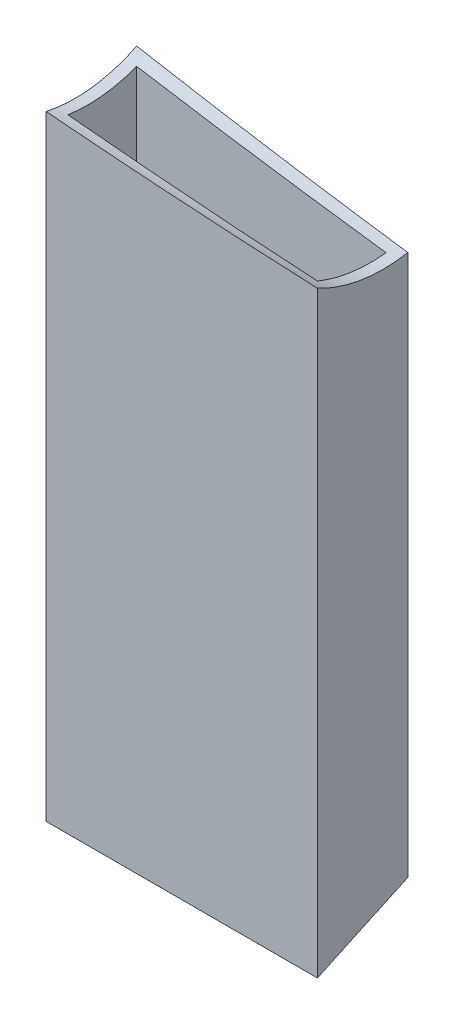
ISO-10303-21;
HEADER;
FILE_DESCRIPTION(('STEP AP214'),'2;1');
FILE_NAME('part.step','',(''),(''),'','','');
FILE_SCHEMA(('AUTOMOTIVE_DESIGN { 1 0 10303 214 1 1 1 1 }'));
ENDSEC;
DATA;
#1=APPLICATION_CONTEXT('core data for automotive mechanical design processes');
#2=APPLICATION_PROTOCOL_DEFINITION('international standard','automotive_design',2000,#1);
#3=PRODUCT_CONTEXT('',#1,'mechanical');
#4=PRODUCT('Part','Part','',(#3));
#5=PRODUCT_RELATED_PRODUCT_CATEGORY('part','',(#4));
#6=PRODUCT_DEFINITION_FORMATION('','',#4);
#7=PRODUCT_DEFINITION_CONTEXT('part definition',#1,'design');
#8=PRODUCT_DEFINITION('design','',#6,#7);
#9=PRODUCT_DEFINITION_SHAPE('','',#8);
#10=(LENGTH_UNIT() NAMED_UNIT(*) SI_UNIT(.MILLI.,.METRE.));
#11=(NAMED_UNIT(*) PLANE_ANGLE_UNIT() SI_UNIT($,.RADIAN.));
#12=(NAMED_UNIT(*) SI_UNIT($,.STERADIAN.) SOLID_ANGLE_UNIT());
#13=UNCERTAINTY_MEASURE_WITH_UNIT(LENGTH_MEASURE(1.E-05),#10,'distance_accuracy_value','');
#14=(GEOMETRIC_REPRESENTATION_CONTEXT(3) GLOBAL_UNCERTAINTY_ASSIGNED_CONTEXT((#13)) GLOBAL_UNIT_ASSIGNED_CONTEXT((#10,
#11,#12)) REPRESENTATION_CONTEXT('',''));
#15=CARTESIAN_POINT('',(0.,0.,0.));
#16=DIRECTION('',(0.,0.,1.));
#17=DIRECTION('',(1.,0.,0.));
#18=AXIS2_PLACEMENT_3D('',#15,#16,#17);
#19=CARTESIAN_POINT('',(-38.1,200.,-12.7));
#20=DIRECTION('',(1.,0.,0.));
#21=DIRECTION('',(0.,0.,-1.));
#22=AXIS2_PLACEMENT_3D('',#19,#20,#21);
#23=PLANE('',#22);
#24=CARTESIAN_POINT('',(-38.1,204.338574419077,5.12923725627169));
#25=DIRECTION('',(1.,0.,0.));
#26=DIRECTION('',(0.,-0.645807827453337,-0.763500000000001));
#27=AXIS2_PLACEMENT_3D('',#24,#25,#26);
#28=ELLIPSE('',#27,38.6877539128469,38.1);
#29=CARTESIAN_POINT('',(-38.1,170.101029529485,-12.7));
#30=VERTEX_POINT('',#29);
#31=CARTESIAN_POINT('',(-38.1,166.86154722495,12.7));
#32=VERTEX_POINT('',#31);
#33=EDGE_CURVE('E168',#30,#32,#28,.F.);
#34=ORIENTED_EDGE('',*,*,#33,.F.);
#35=DIRECTION('',(0.,-1.,0.));
#36=VECTOR('',#35,1.);
#37=CARTESIAN_POINT('',(-38.1,200.,-12.7));
#38=LINE('',#37,#36);
#39=CARTESIAN_POINT('',(-38.1,5.89160522769183,-12.7));
#40=VERTEX_POINT('',#39);
#41=EDGE_CURVE('E124',#30,#40,#38,.T.);
#42=ORIENTED_EDGE('',*,*,#41,.T.);
#43=DIRECTION('',(0.,-0.420827858242934,0.907140514874441));
#44=VECTOR('',#43,1.);
#45=CARTESIAN_POINT('',(-38.1,-8.7885305791334,18.9446397104788));
#46=LINE('',#45,#44);
#47=CARTESIAN_POINT('',(-38.1,-5.89160522769178,12.7));
#48=VERTEX_POINT('',#47);
#49=EDGE_CURVE('E161',#40,#48,#46,.T.);
#50=ORIENTED_EDGE('',*,*,#49,.T.);
#51=DIRECTION('',(0.,-1.,0.));
#52=VECTOR('',#51,1.);
#53=CARTESIAN_POINT('',(-38.1,200.,12.7));
#54=LINE('',#53,#52);
#55=EDGE_CURVE('E130',#32,#48,#54,.T.);
#56=ORIENTED_EDGE('',*,*,#55,.F.);
#57=EDGE_LOOP('',(#34,#42,#50,#56));
#58=FACE_BOUND('',#57,.T.);
#59=ADVANCED_FACE('F36',(#58),#23,.F.);
#60=CARTESIAN_POINT('',(-38.1,200.,12.7));
#61=DIRECTION('',(0.,0.,-1.));
#62=DIRECTION('',(-1.,0.,0.));
#63=AXIS2_PLACEMENT_3D('',#60,#61,#62);
#64=PLANE('',#63);
#65=CARTESIAN_POINT('',(-94.3356635352276,210.742317496604,12.7));
#66=DIRECTION('',(0.,0.,-1.));
#67=DIRECTION('',(0.993578812003704,-0.113142142181011,0.));
#68=AXIS2_PLACEMENT_3D('',#65,#66,#67);
#69=ELLIPSE('',#68,287.372829610709,38.1);
#70=CARTESIAN_POINT('',(38.1,161.960803613142,12.7));
#71=VERTEX_POINT('',#70);
#72=EDGE_CURVE('E172',#32,#71,#69,.F.);
#73=ORIENTED_EDGE('',*,*,#72,.F.);
#74=ORIENTED_EDGE('',*,*,#55,.T.);
#75=DIRECTION('',(1.,0.,0.));
#76=VECTOR('',#75,1.);
#77=CARTESIAN_POINT('',(-38.1,-5.89160522769178,12.7));
#78=LINE('',#77,#76);
#79=CARTESIAN_POINT('',(38.1,-5.89160522769177,12.7));
#80=VERTEX_POINT('',#79);
#81=EDGE_CURVE('E119',#48,#80,#78,.T.);
#82=ORIENTED_EDGE('',*,*,#81,.T.);
#83=DIRECTION('',(0.,-1.,0.));
#84=VECTOR('',#83,1.);
#85=CARTESIAN_POINT('',(38.1,200.,12.7));
#86=LINE('',#85,#84);
#87=EDGE_CURVE('E128',#71,#80,#86,.T.);
#88=ORIENTED_EDGE('',*,*,#87,.F.);
#89=EDGE_LOOP('',(#73,#74,#82,#88));
#90=FACE_BOUND('',#89,.T.);
#91=ADVANCED_FACE('F155',(#90),#64,.F.);
#92=CARTESIAN_POINT('',(38.1,200.,-12.7));
#93=DIRECTION('',(-1.,0.,0.));
#94=DIRECTION('',(0.,0.,1.));
#95=AXIS2_PLACEMENT_3D('',#92,#93,#94);
#96=PLANE('',#95);
#97=CARTESIAN_POINT('',(38.1,195.661425580923,-5.1292372562717));
#98=DIRECTION('',(-1.,0.,0.));
#99=DIRECTION('',(0.,-0.645807827453337,-0.763500000000001));
#100=AXIS2_PLACEMENT_3D('',#97,#98,#99);
#101=ELLIPSE('',#100,38.6877539128469,38.1);
#102=CARTESIAN_POINT('',(38.1,157.956406802283,-12.7));
#103=VERTEX_POINT('',#102);
#104=EDGE_CURVE('E50',#71,#103,#101,.F.);
#105=ORIENTED_EDGE('',*,*,#104,.F.);
#106=ORIENTED_EDGE('',*,*,#87,.T.);
#107=DIRECTION('',(0.,-0.420827858242934,0.907140514874441));
#108=VECTOR('',#107,1.);
#109=CARTESIAN_POINT('',(38.1,-8.7885305791334,18.9446397104788));
#110=LINE('',#109,#108);
#111=CARTESIAN_POINT('',(38.1,5.89160522769177,-12.7));
#112=VERTEX_POINT('',#111);
#113=EDGE_CURVE('E163',#112,#80,#110,.T.);
#114=ORIENTED_EDGE('',*,*,#113,.F.);
#115=DIRECTION('',(0.,-1.,0.));
#116=VECTOR('',#115,1.);
#117=CARTESIAN_POINT('',(38.1,200.,-12.7));
#118=LINE('',#117,#116);
#119=EDGE_CURVE('E126',#103,#112,#118,.T.);
#120=ORIENTED_EDGE('',*,*,#119,.F.);
#121=EDGE_LOOP('',(#105,#106,#114,#120));
#122=FACE_BOUND('',#121,.T.);
#123=ADVANCED_FACE('F193',(#122),#96,.F.);
#124=CARTESIAN_POINT('',(-38.1,200.,-12.7));
#125=DIRECTION('',(0.,0.,1.));
#126=DIRECTION('',(1.,0.,0.));
#127=AXIS2_PLACEMENT_3D('',#124,#125,#126);
#128=PLANE('',#127);
#129=CARTESIAN_POINT('',(94.3356635352274,189.257682503396,-12.7));
#130=DIRECTION('',(0.,0.,1.));
#131=DIRECTION('',(0.993578812003704,-0.113142142181011,0.));
#132=AXIS2_PLACEMENT_3D('',#129,#130,#131);
#133=ELLIPSE('',#132,287.372829610709,38.1);
#134=EDGE_CURVE('E175',#103,#30,#133,.F.);
#135=ORIENTED_EDGE('',*,*,#134,.F.);
#136=ORIENTED_EDGE('',*,*,#119,.T.);
#137=DIRECTION('',(-1.,0.,0.));
#138=VECTOR('',#137,1.);
#139=CARTESIAN_POINT('',(-38.1,5.89160522769178,-12.7));
#140=LINE('',#139,#138);
#141=EDGE_CURVE('E143',#112,#40,#140,.T.);
#142=ORIENTED_EDGE('',*,*,#141,.T.);
#143=ORIENTED_EDGE('',*,*,#41,.F.);
#144=EDGE_LOOP('',(#135,#136,#142,#143));
#145=FACE_BOUND('',#144,.T.);
#146=ADVANCED_FACE('F187',(#145),#128,.F.);
#147=CARTESIAN_POINT('',(-35.052,200.,-9.65199999999999));
#148=DIRECTION('',(1.,0.,0.));
#149=DIRECTION('',(0.,0.,-1.));
#150=AXIS2_PLACEMENT_3D('',#147,#148,#149);
#151=PLANE('',#150);
#152=DIRECTION('',(0.,-1.,0.));
#153=VECTOR('',#152,1.);
#154=CARTESIAN_POINT('',(-35.052,200.,-9.65199999999999));
#155=LINE('',#154,#153);
#156=CARTESIAN_POINT('',(-35.052,168.212925121954,-9.65199999999999));
#157=VERTEX_POINT('',#156);
#158=CARTESIAN_POINT('',(-35.052,4.47761997304577,-9.65199999999999));
#159=VERTEX_POINT('',#158);
#160=EDGE_CURVE('E115',#157,#159,#155,.T.);
#161=ORIENTED_EDGE('',*,*,#160,.F.);
#162=CARTESIAN_POINT('',(-35.052,203.991488465551,4.71889827576995));
#163=DIRECTION('',(1.,0.,0.));
#164=DIRECTION('',(0.,-0.645807827453337,-0.763500000000001));
#165=AXIS2_PLACEMENT_3D('',#162,#163,#164);
#166=ELLIPSE('',#165,38.6877539128469,38.1);
#167=CARTESIAN_POINT('',(-35.052,166.040888859006,9.652));
#168=VERTEX_POINT('',#167);
#169=EDGE_CURVE('E58',#157,#168,#166,.F.);
#170=ORIENTED_EDGE('',*,*,#169,.T.);
#171=DIRECTION('',(0.,-1.,0.));
#172=VECTOR('',#171,1.);
#173=CARTESIAN_POINT('',(-35.052,200.,9.652));
#174=LINE('',#173,#172);
#175=CARTESIAN_POINT('',(-35.052,-4.47761997304574,9.652));
#176=VERTEX_POINT('',#175);
#177=EDGE_CURVE('E117',#168,#176,#174,.T.);
#178=ORIENTED_EDGE('',*,*,#177,.T.);
#179=DIRECTION('',(0.,-0.420827858242934,0.907140514874441));
#180=VECTOR('',#179,1.);
#181=CARTESIAN_POINT('',(-35.052,39.103868254667,-84.2926685752904));
#182=LINE('',#181,#180);
#183=EDGE_CURVE('E137',#159,#176,#182,.T.);
#184=ORIENTED_EDGE('',*,*,#183,.F.);
#185=EDGE_LOOP('',(#161,#170,#178,#184));
#186=FACE_BOUND('',#185,.T.);
#187=ADVANCED_FACE('F141',(#186),#151,.T.);
#188=CARTESIAN_POINT('',(-35.052,200.,9.652));
#189=DIRECTION('',(0.,0.,-1.));
#190=DIRECTION('',(-1.,0.,0.));
#191=AXIS2_PLACEMENT_3D('',#188,#189,#190);
#192=PLANE('',#191);
#193=ORIENTED_EDGE('',*,*,#177,.F.);
#194=CARTESIAN_POINT('',(-71.695104286773,208.164161297419,9.65200000000001));
#195=DIRECTION('',(0.,0.,-1.));
#196=DIRECTION('',(0.993578812003704,-0.113142142181011,0.));
#197=AXIS2_PLACEMENT_3D('',#194,#195,#196);
#198=ELLIPSE('',#197,287.372829610709,38.1);
#199=CARTESIAN_POINT('',(35.052,160.662724118413,9.65199999999999));
#200=VERTEX_POINT('',#199);
#201=EDGE_CURVE('E110',#168,#200,#198,.F.);
#202=ORIENTED_EDGE('',*,*,#201,.T.);
#203=DIRECTION('',(0.,-1.,0.));
#204=VECTOR('',#203,1.);
#205=CARTESIAN_POINT('',(35.052,200.,9.65199999999999));
#206=LINE('',#205,#204);
#207=CARTESIAN_POINT('',(35.052,-4.47761997304574,9.65199999999998));
#208=VERTEX_POINT('',#207);
#209=EDGE_CURVE('E109',#200,#208,#206,.T.);
#210=ORIENTED_EDGE('',*,*,#209,.T.);
#211=DIRECTION('',(1.,0.,0.));
#212=VECTOR('',#211,1.);
#213=CARTESIAN_POINT('',(-35.052,-4.47761997304574,9.652));
#214=LINE('',#213,#212);
#215=EDGE_CURVE('E144',#176,#208,#214,.T.);
#216=ORIENTED_EDGE('',*,*,#215,.F.);
#217=EDGE_LOOP('',(#193,#202,#210,#216));
#218=FACE_BOUND('',#217,.T.);
#219=ADVANCED_FACE('F179',(#218),#192,.T.);
#220=CARTESIAN_POINT('',(35.052,200.,-9.652));
#221=DIRECTION('',(-1.,0.,0.));
#222=DIRECTION('',(0.,0.,1.));
#223=AXIS2_PLACEMENT_3D('',#220,#221,#222);
#224=PLANE('',#223);
#225=ORIENTED_EDGE('',*,*,#209,.F.);
#226=CARTESIAN_POINT('',(35.052,196.008511534449,-4.71889827576997));
#227=DIRECTION('',(-1.,0.,0.));
#228=DIRECTION('',(0.,-0.645807827453337,-0.763500000000001));
#229=AXIS2_PLACEMENT_3D('',#226,#227,#228);
#230=ELLIPSE('',#229,38.6877539128469,38.1);
#231=CARTESIAN_POINT('',(35.052,157.909352830659,-9.652));
#232=VERTEX_POINT('',#231);
#233=EDGE_CURVE('E98',#200,#232,#230,.F.);
#234=ORIENTED_EDGE('',*,*,#233,.T.);
#235=DIRECTION('',(0.,-1.,0.));
#236=VECTOR('',#235,1.);
#237=CARTESIAN_POINT('',(35.052,200.,-9.652));
#238=LINE('',#237,#236);
#239=CARTESIAN_POINT('',(35.052,4.47761997304583,-9.652));
#240=VERTEX_POINT('',#239);
#241=EDGE_CURVE('E107',#232,#240,#238,.T.);
#242=ORIENTED_EDGE('',*,*,#241,.T.);
#243=DIRECTION('',(0.,0.420827858242934,-0.907140514874441));
#244=VECTOR('',#243,1.);
#245=CARTESIAN_POINT('',(35.052,39.103868254667,-84.2926685752904));
#246=LINE('',#245,#244);
#247=EDGE_CURVE('E139',#208,#240,#246,.T.);
#248=ORIENTED_EDGE('',*,*,#247,.F.);
#249=EDGE_LOOP('',(#225,#234,#242,#248));
#250=FACE_BOUND('',#249,.T.);
#251=ADVANCED_FACE('F105',(#250),#224,.T.);
#252=CARTESIAN_POINT('',(-35.052,200.,-9.65199999999999));
#253=DIRECTION('',(0.,0.,1.));
#254=DIRECTION('',(1.,0.,0.));
#255=AXIS2_PLACEMENT_3D('',#252,#253,#254);
#256=PLANE('',#255);
#257=ORIENTED_EDGE('',*,*,#241,.F.);
#258=CARTESIAN_POINT('',(71.6951042867728,191.835838702581,-9.652));
#259=DIRECTION('',(0.,0.,1.));
#260=DIRECTION('',(0.993578812003704,-0.113142142181011,0.));
#261=AXIS2_PLACEMENT_3D('',#258,#259,#260);
#262=ELLIPSE('',#261,287.372829610709,38.1);
#263=EDGE_CURVE('E11',#232,#157,#262,.F.);
#264=ORIENTED_EDGE('',*,*,#263,.T.);
#265=ORIENTED_EDGE('',*,*,#160,.T.);
#266=DIRECTION('',(-1.,0.,0.));
#267=VECTOR('',#266,1.);
#268=CARTESIAN_POINT('',(-35.052,4.47761997304577,-9.65199999999999));
#269=LINE('',#268,#267);
#270=EDGE_CURVE('E43',#240,#159,#269,.T.);
#271=ORIENTED_EDGE('',*,*,#270,.F.);
#272=EDGE_LOOP('',(#257,#264,#265,#271));
#273=FACE_BOUND('',#272,.T.);
#274=ADVANCED_FACE('F113',(#273),#256,.T.);
#275=CARTESIAN_POINT('',(-38.1,-8.7885305791334,18.9446397104788));
#276=DIRECTION('',(0.,0.90714051487444,0.420827858242934));
#277=DIRECTION('',(0.,-0.420827858242934,0.907140514874441));
#278=AXIS2_PLACEMENT_3D('',#275,#276,#277);
#279=PLANE('',#278);
#280=ORIENTED_EDGE('',*,*,#183,.T.);
#281=ORIENTED_EDGE('',*,*,#215,.T.);
#282=ORIENTED_EDGE('',*,*,#247,.T.);
#283=ORIENTED_EDGE('',*,*,#270,.T.);
#284=EDGE_LOOP('',(#280,#281,#282,#283));
#285=FACE_BOUND('',#284,.T.);
#286=ORIENTED_EDGE('',*,*,#49,.F.);
#287=ORIENTED_EDGE('',*,*,#141,.F.);
#288=ORIENTED_EDGE('',*,*,#113,.T.);
#289=ORIENTED_EDGE('',*,*,#81,.F.);
#290=EDGE_LOOP('',(#286,#287,#288,#289));
#291=FACE_BOUND('',#290,.T.);
#292=ADVANCED_FACE('F134',(#285,#291),#279,.F.);
#293=CARTESIAN_POINT('',(-192.340643032274,221.902472273194,25.8939840455746));
#294=DIRECTION('',(0.984807753012209,-0.112143352360309,-0.132580383648699));
#295=DIRECTION('',(-0.133422004439213,0.,-0.991059316454582));
#296=AXIS2_PLACEMENT_3D('',#293,#294,#295);
#297=CYLINDRICAL_SURFACE('',#296,38.1);
#298=ORIENTED_EDGE('',*,*,#263,.F.);
#299=ORIENTED_EDGE('',*,*,#233,.F.);
#300=ORIENTED_EDGE('',*,*,#201,.F.);
#301=ORIENTED_EDGE('',*,*,#169,.F.);
#302=EDGE_LOOP('',(#298,#299,#300,#301));
#303=FACE_BOUND('',#302,.T.);
#304=ORIENTED_EDGE('',*,*,#33,.T.);
#305=ORIENTED_EDGE('',*,*,#72,.T.);
#306=ORIENTED_EDGE('',*,*,#104,.T.);
#307=ORIENTED_EDGE('',*,*,#134,.T.);
#308=EDGE_LOOP('',(#304,#305,#306,#307));
#309=FACE_BOUND('',#308,.T.);
#310=ADVANCED_FACE('F97',(#303,#309),#297,.F.);
#311=CLOSED_SHELL('',(#59,#91,#123,#146,#187,#219,#251,#274,#292,#310));
#312=MANIFOLD_SOLID_BREP('B2',#311);
#313=ADVANCED_BREP_SHAPE_REPRESENTATION('',(#18,#312),#14);
#314=SHAPE_DEFINITION_REPRESENTATION(#9,#313);
ENDSEC;
END-ISO-10303-21;
